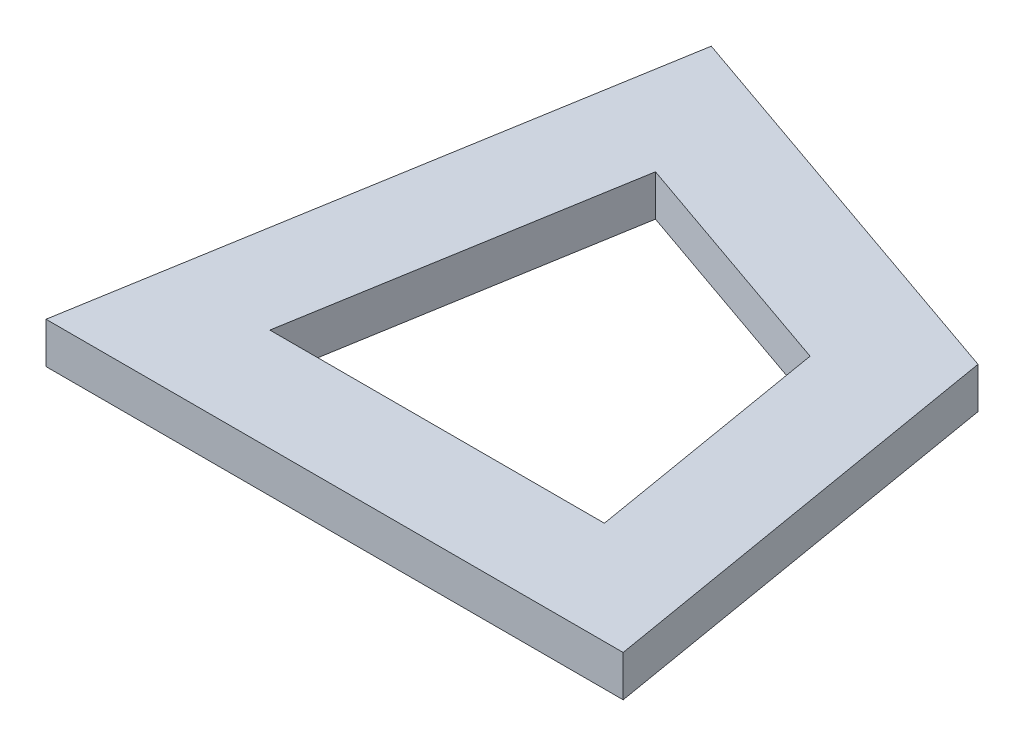
ISO-10303-21;
HEADER;
FILE_DESCRIPTION(('STEP AP214'),'2;1');
FILE_NAME('part.step','',(''),(''),'','','');
FILE_SCHEMA(('AUTOMOTIVE_DESIGN { 1 0 10303 214 1 1 1 1 }'));
ENDSEC;
DATA;
#1=APPLICATION_CONTEXT('core data for automotive mechanical design processes');
#2=APPLICATION_PROTOCOL_DEFINITION('international standard','automotive_design',2000,#1);
#3=PRODUCT_CONTEXT('',#1,'mechanical');
#4=PRODUCT('Part','Part','',(#3));
#5=PRODUCT_RELATED_PRODUCT_CATEGORY('part','',(#4));
#6=PRODUCT_DEFINITION_FORMATION('','',#4);
#7=PRODUCT_DEFINITION_CONTEXT('part definition',#1,'design');
#8=PRODUCT_DEFINITION('design','',#6,#7);
#9=PRODUCT_DEFINITION_SHAPE('','',#8);
#10=(LENGTH_UNIT() NAMED_UNIT(*) SI_UNIT(.MILLI.,.METRE.));
#11=(NAMED_UNIT(*) PLANE_ANGLE_UNIT() SI_UNIT($,.RADIAN.));
#12=(NAMED_UNIT(*) SI_UNIT($,.STERADIAN.) SOLID_ANGLE_UNIT());
#13=UNCERTAINTY_MEASURE_WITH_UNIT(LENGTH_MEASURE(1.E-05),#10,'distance_accuracy_value','');
#14=(GEOMETRIC_REPRESENTATION_CONTEXT(3) GLOBAL_UNCERTAINTY_ASSIGNED_CONTEXT((#13)) GLOBAL_UNIT_ASSIGNED_CONTEXT((#10,
#11,#12)) REPRESENTATION_CONTEXT('',''));
#15=CARTESIAN_POINT('',(0.,0.,0.));
#16=DIRECTION('',(0.,0.,1.));
#17=DIRECTION('',(1.,0.,0.));
#18=AXIS2_PLACEMENT_3D('',#15,#16,#17);
#19=CARTESIAN_POINT('',(0.,2.,0.));
#20=DIRECTION('',(0.,-1.,0.));
#21=DIRECTION('',(0.,0.,-1.));
#22=AXIS2_PLACEMENT_3D('',#19,#20,#21);
#23=PLANE('',#22);
#24=DIRECTION('',(-0.166596655404362,0.,0.986025128689974));
#25=VECTOR('',#24,1.);
#26=CARTESIAN_POINT('',(4.68856094490314,2.,-27.7498902834989));
#27=LINE('',#26,#25);
#28=CARTESIAN_POINT('',(4.68856094490314,2.,-27.7498902834989));
#29=VERTEX_POINT('',#28);
#30=CARTESIAN_POINT('',(0.,2.,0.));
#31=VERTEX_POINT('',#30);
#32=EDGE_CURVE('E140',#29,#31,#27,.T.);
#33=ORIENTED_EDGE('',*,*,#32,.T.);
#34=DIRECTION('',(1.,0.,0.));
#35=VECTOR('',#34,1.);
#36=CARTESIAN_POINT('',(0.,2.,0.));
#37=LINE('',#36,#35);
#38=CARTESIAN_POINT('',(28.14318771,2.,0.));
#39=VERTEX_POINT('',#38);
#40=EDGE_CURVE('E143',#31,#39,#37,.T.);
#41=ORIENTED_EDGE('',*,*,#40,.T.);
#42=DIRECTION('',(-0.166596655404362,0.,-0.986025128689974));
#43=VECTOR('',#42,1.);
#44=CARTESIAN_POINT('',(28.14318771,2.,0.));
#45=LINE('',#44,#43);
#46=CARTESIAN_POINT('',(24.6256301988549,2.,-20.8191460337713));
#47=VERTEX_POINT('',#46);
#48=EDGE_CURVE('E146',#39,#47,#45,.T.);
#49=ORIENTED_EDGE('',*,*,#48,.T.);
#50=DIRECTION('',(-0.944553945341675,0.,-0.328356276534311));
#51=VECTOR('',#50,1.);
#52=CARTESIAN_POINT('',(24.6256301988549,2.,-20.8191460337713));
#53=LINE('',#52,#51);
#54=EDGE_CURVE('E148',#47,#29,#53,.T.);
#55=ORIENTED_EDGE('',*,*,#54,.T.);
#56=EDGE_LOOP('',(#33,#41,#49,#55));
#57=FACE_BOUND('',#56,.T.);
#58=DIRECTION('',(-0.944553945341675,0.,-0.328356276534311));
#59=VECTOR('',#58,1.);
#60=CARTESIAN_POINT('',(20.1885314729947,2.,-17.068115400492));
#61=LINE('',#60,#59);
#62=CARTESIAN_POINT('',(20.1885314729947,2.,-17.068115400492));
#63=VERTEX_POINT('',#62);
#64=CARTESIAN_POINT('',(8.63334965072713,2.,-21.0850553503477));
#65=VERTEX_POINT('',#64);
#66=EDGE_CURVE('E104',#63,#65,#61,.T.);
#67=ORIENTED_EDGE('',*,*,#66,.F.);
#68=DIRECTION('',(-0.166596655404362,0.,-0.986025128689974));
#69=VECTOR('',#68,1.);
#70=CARTESIAN_POINT('',(22.2275339327261,2.,-5.));
#71=LINE('',#70,#69);
#72=CARTESIAN_POINT('',(22.2275339327261,2.,-5.));
#73=VERTEX_POINT('',#72);
#74=EDGE_CURVE('E126',#73,#63,#71,.T.);
#75=ORIENTED_EDGE('',*,*,#74,.F.);
#76=DIRECTION('',(1.,0.,0.));
#77=VECTOR('',#76,1.);
#78=CARTESIAN_POINT('',(5.91565377727388,2.,-5.));
#79=LINE('',#78,#77);
#80=CARTESIAN_POINT('',(5.91565377727388,2.,-5.));
#81=VERTEX_POINT('',#80);
#82=EDGE_CURVE('E124',#81,#73,#79,.T.);
#83=ORIENTED_EDGE('',*,*,#82,.F.);
#84=DIRECTION('',(-0.166596655404362,0.,0.986025128689974));
#85=VECTOR('',#84,1.);
#86=CARTESIAN_POINT('',(8.63334965072713,2.,-21.0850553503477));
#87=LINE('',#86,#85);
#88=EDGE_CURVE('E112',#65,#81,#87,.T.);
#89=ORIENTED_EDGE('',*,*,#88,.F.);
#90=EDGE_LOOP('',(#67,#75,#83,#89));
#91=FACE_BOUND('',#90,.T.);
#92=ADVANCED_FACE('F39',(#57,#91),#23,.F.);
#93=CARTESIAN_POINT('',(0.,0.,0.));
#94=DIRECTION('',(0.,-1.,0.));
#95=DIRECTION('',(0.,0.,-1.));
#96=AXIS2_PLACEMENT_3D('',#93,#94,#95);
#97=PLANE('',#96);
#98=DIRECTION('',(-0.166596655404362,0.,0.986025128689974));
#99=VECTOR('',#98,1.);
#100=CARTESIAN_POINT('',(4.68856094490314,0.,-27.7498902834989));
#101=LINE('',#100,#99);
#102=CARTESIAN_POINT('',(4.68856094490314,0.,-27.7498902834989));
#103=VERTEX_POINT('',#102);
#104=CARTESIAN_POINT('',(0.,0.,0.));
#105=VERTEX_POINT('',#104);
#106=EDGE_CURVE('E120',#103,#105,#101,.T.);
#107=ORIENTED_EDGE('',*,*,#106,.F.);
#108=DIRECTION('',(-0.944553945341675,0.,-0.328356276534311));
#109=VECTOR('',#108,1.);
#110=CARTESIAN_POINT('',(24.6256301988549,0.,-20.8191460337713));
#111=LINE('',#110,#109);
#112=CARTESIAN_POINT('',(24.6256301988549,0.,-20.8191460337713));
#113=VERTEX_POINT('',#112);
#114=EDGE_CURVE('E144',#113,#103,#111,.T.);
#115=ORIENTED_EDGE('',*,*,#114,.F.);
#116=DIRECTION('',(-0.166596655404362,0.,-0.986025128689974));
#117=VECTOR('',#116,1.);
#118=CARTESIAN_POINT('',(28.14318771,0.,0.));
#119=LINE('',#118,#117);
#120=CARTESIAN_POINT('',(28.14318771,0.,0.));
#121=VERTEX_POINT('',#120);
#122=EDGE_CURVE('E155',#121,#113,#119,.T.);
#123=ORIENTED_EDGE('',*,*,#122,.F.);
#124=DIRECTION('',(1.,0.,0.));
#125=VECTOR('',#124,1.);
#126=CARTESIAN_POINT('',(0.,0.,0.));
#127=LINE('',#126,#125);
#128=EDGE_CURVE('E153',#105,#121,#127,.T.);
#129=ORIENTED_EDGE('',*,*,#128,.F.);
#130=EDGE_LOOP('',(#107,#115,#123,#129));
#131=FACE_BOUND('',#130,.T.);
#132=DIRECTION('',(-0.166596655404362,0.,-0.986025128689974));
#133=VECTOR('',#132,1.);
#134=CARTESIAN_POINT('',(22.2275339327261,0.,-5.));
#135=LINE('',#134,#133);
#136=CARTESIAN_POINT('',(22.2275339327261,0.,-5.));
#137=VERTEX_POINT('',#136);
#138=CARTESIAN_POINT('',(20.1885314729947,0.,-17.068115400492));
#139=VERTEX_POINT('',#138);
#140=EDGE_CURVE('E113',#137,#139,#135,.T.);
#141=ORIENTED_EDGE('',*,*,#140,.T.);
#142=DIRECTION('',(-0.944553945341675,0.,-0.328356276534311));
#143=VECTOR('',#142,1.);
#144=CARTESIAN_POINT('',(20.1885314729947,0.,-17.068115400492));
#145=LINE('',#144,#143);
#146=CARTESIAN_POINT('',(8.63334965072713,0.,-21.0850553503477));
#147=VERTEX_POINT('',#146);
#148=EDGE_CURVE('E62',#139,#147,#145,.T.);
#149=ORIENTED_EDGE('',*,*,#148,.T.);
#150=DIRECTION('',(-0.166596655404362,0.,0.986025128689974));
#151=VECTOR('',#150,1.);
#152=CARTESIAN_POINT('',(8.63334965072713,0.,-21.0850553503477));
#153=LINE('',#152,#151);
#154=CARTESIAN_POINT('',(5.91565377727388,0.,-5.));
#155=VERTEX_POINT('',#154);
#156=EDGE_CURVE('E119',#147,#155,#153,.T.);
#157=ORIENTED_EDGE('',*,*,#156,.T.);
#158=DIRECTION('',(1.,0.,0.));
#159=VECTOR('',#158,1.);
#160=CARTESIAN_POINT('',(5.91565377727388,0.,-5.));
#161=LINE('',#160,#159);
#162=EDGE_CURVE('E132',#155,#137,#161,.T.);
#163=ORIENTED_EDGE('',*,*,#162,.T.);
#164=EDGE_LOOP('',(#141,#149,#157,#163));
#165=FACE_BOUND('',#164,.T.);
#166=ADVANCED_FACE('F173',(#131,#165),#97,.T.);
#167=CARTESIAN_POINT('',(4.68856094490314,2.,-27.7498902834989));
#168=DIRECTION('',(0.986025128689974,0.,0.166596655404362));
#169=DIRECTION('',(0.166596655404362,0.,-0.986025128689974));
#170=AXIS2_PLACEMENT_3D('',#167,#168,#169);
#171=PLANE('',#170);
#172=ORIENTED_EDGE('',*,*,#106,.T.);
#173=DIRECTION('',(0.,-1.,0.));
#174=VECTOR('',#173,1.);
#175=CARTESIAN_POINT('',(0.,2.,0.));
#176=LINE('',#175,#174);
#177=EDGE_CURVE('E11',#31,#105,#176,.T.);
#178=ORIENTED_EDGE('',*,*,#177,.F.);
#179=ORIENTED_EDGE('',*,*,#32,.F.);
#180=DIRECTION('',(0.,-1.,0.));
#181=VECTOR('',#180,1.);
#182=CARTESIAN_POINT('',(4.68856094490314,2.,-27.7498902834989));
#183=LINE('',#182,#181);
#184=EDGE_CURVE('E150',#29,#103,#183,.T.);
#185=ORIENTED_EDGE('',*,*,#184,.T.);
#186=EDGE_LOOP('',(#172,#178,#179,#185));
#187=FACE_BOUND('',#186,.T.);
#188=ADVANCED_FACE('F41',(#187),#171,.F.);
#189=CARTESIAN_POINT('',(0.,2.,0.));
#190=DIRECTION('',(0.,0.,-1.));
#191=DIRECTION('',(-1.,0.,0.));
#192=AXIS2_PLACEMENT_3D('',#189,#190,#191);
#193=PLANE('',#192);
#194=ORIENTED_EDGE('',*,*,#128,.T.);
#195=DIRECTION('',(0.,-1.,0.));
#196=VECTOR('',#195,1.);
#197=CARTESIAN_POINT('',(28.14318771,2.,0.));
#198=LINE('',#197,#196);
#199=EDGE_CURVE('E47',#39,#121,#198,.T.);
#200=ORIENTED_EDGE('',*,*,#199,.F.);
#201=ORIENTED_EDGE('',*,*,#40,.F.);
#202=ORIENTED_EDGE('',*,*,#177,.T.);
#203=EDGE_LOOP('',(#194,#200,#201,#202));
#204=FACE_BOUND('',#203,.T.);
#205=ADVANCED_FACE('F183',(#204),#193,.F.);
#206=CARTESIAN_POINT('',(28.14318771,2.,0.));
#207=DIRECTION('',(-0.986025128689974,0.,0.166596655404362));
#208=DIRECTION('',(0.166596655404362,0.,0.986025128689974));
#209=AXIS2_PLACEMENT_3D('',#206,#207,#208);
#210=PLANE('',#209);
#211=ORIENTED_EDGE('',*,*,#122,.T.);
#212=DIRECTION('',(0.,-1.,0.));
#213=VECTOR('',#212,1.);
#214=CARTESIAN_POINT('',(24.6256301988549,2.,-20.8191460337713));
#215=LINE('',#214,#213);
#216=EDGE_CURVE('E160',#47,#113,#215,.T.);
#217=ORIENTED_EDGE('',*,*,#216,.F.);
#218=ORIENTED_EDGE('',*,*,#48,.F.);
#219=ORIENTED_EDGE('',*,*,#199,.T.);
#220=EDGE_LOOP('',(#211,#217,#218,#219));
#221=FACE_BOUND('',#220,.T.);
#222=ADVANCED_FACE('F167',(#221),#210,.F.);
#223=CARTESIAN_POINT('',(24.6256301988549,2.,-20.8191460337713));
#224=DIRECTION('',(-0.328356276534311,0.,0.944553945341675));
#225=DIRECTION('',(0.944553945341675,0.,0.328356276534311));
#226=AXIS2_PLACEMENT_3D('',#223,#224,#225);
#227=PLANE('',#226);
#228=ORIENTED_EDGE('',*,*,#114,.T.);
#229=ORIENTED_EDGE('',*,*,#184,.F.);
#230=ORIENTED_EDGE('',*,*,#54,.F.);
#231=ORIENTED_EDGE('',*,*,#216,.T.);
#232=EDGE_LOOP('',(#228,#229,#230,#231));
#233=FACE_BOUND('',#232,.T.);
#234=ADVANCED_FACE('F177',(#233),#227,.F.);
#235=CARTESIAN_POINT('',(20.1885314729947,2.,-17.068115400492));
#236=DIRECTION('',(-0.328356276534311,0.,0.944553945341675));
#237=DIRECTION('',(0.944553945341675,0.,0.328356276534311));
#238=AXIS2_PLACEMENT_3D('',#235,#236,#237);
#239=PLANE('',#238);
#240=ORIENTED_EDGE('',*,*,#148,.F.);
#241=DIRECTION('',(0.,-1.,0.));
#242=VECTOR('',#241,1.);
#243=CARTESIAN_POINT('',(20.1885314729947,2.,-17.068115400492));
#244=LINE('',#243,#242);
#245=EDGE_CURVE('E108',#63,#139,#244,.T.);
#246=ORIENTED_EDGE('',*,*,#245,.F.);
#247=ORIENTED_EDGE('',*,*,#66,.T.);
#248=DIRECTION('',(0.,-1.,0.));
#249=VECTOR('',#248,1.);
#250=CARTESIAN_POINT('',(8.63334965072713,2.,-21.0850553503477));
#251=LINE('',#250,#249);
#252=EDGE_CURVE('E107',#65,#147,#251,.T.);
#253=ORIENTED_EDGE('',*,*,#252,.T.);
#254=EDGE_LOOP('',(#240,#246,#247,#253));
#255=FACE_BOUND('',#254,.T.);
#256=ADVANCED_FACE('F106',(#255),#239,.T.);
#257=CARTESIAN_POINT('',(8.63334965072713,2.,-21.0850553503477));
#258=DIRECTION('',(0.986025128689974,0.,0.166596655404362));
#259=DIRECTION('',(0.166596655404362,0.,-0.986025128689974));
#260=AXIS2_PLACEMENT_3D('',#257,#258,#259);
#261=PLANE('',#260);
#262=ORIENTED_EDGE('',*,*,#156,.F.);
#263=ORIENTED_EDGE('',*,*,#252,.F.);
#264=ORIENTED_EDGE('',*,*,#88,.T.);
#265=DIRECTION('',(0.,-1.,0.));
#266=VECTOR('',#265,1.);
#267=CARTESIAN_POINT('',(5.91565377727388,2.,-5.));
#268=LINE('',#267,#266);
#269=EDGE_CURVE('E121',#81,#155,#268,.T.);
#270=ORIENTED_EDGE('',*,*,#269,.T.);
#271=EDGE_LOOP('',(#262,#263,#264,#270));
#272=FACE_BOUND('',#271,.T.);
#273=ADVANCED_FACE('F116',(#272),#261,.T.);
#274=CARTESIAN_POINT('',(5.91565377727388,2.,-5.));
#275=DIRECTION('',(0.,0.,-1.));
#276=DIRECTION('',(-1.,0.,0.));
#277=AXIS2_PLACEMENT_3D('',#274,#275,#276);
#278=PLANE('',#277);
#279=ORIENTED_EDGE('',*,*,#162,.F.);
#280=ORIENTED_EDGE('',*,*,#269,.F.);
#281=ORIENTED_EDGE('',*,*,#82,.T.);
#282=DIRECTION('',(0.,-1.,0.));
#283=VECTOR('',#282,1.);
#284=CARTESIAN_POINT('',(22.2275339327261,2.,-5.));
#285=LINE('',#284,#283);
#286=EDGE_CURVE('E54',#73,#137,#285,.T.);
#287=ORIENTED_EDGE('',*,*,#286,.T.);
#288=EDGE_LOOP('',(#279,#280,#281,#287));
#289=FACE_BOUND('',#288,.T.);
#290=ADVANCED_FACE('F206',(#289),#278,.T.);
#291=CARTESIAN_POINT('',(22.2275339327261,2.,-5.));
#292=DIRECTION('',(-0.986025128689974,0.,0.166596655404362));
#293=DIRECTION('',(0.166596655404362,0.,0.986025128689974));
#294=AXIS2_PLACEMENT_3D('',#291,#292,#293);
#295=PLANE('',#294);
#296=ORIENTED_EDGE('',*,*,#140,.F.);
#297=ORIENTED_EDGE('',*,*,#286,.F.);
#298=ORIENTED_EDGE('',*,*,#74,.T.);
#299=ORIENTED_EDGE('',*,*,#245,.T.);
#300=EDGE_LOOP('',(#296,#297,#298,#299));
#301=FACE_BOUND('',#300,.T.);
#302=ADVANCED_FACE('F210',(#301),#295,.T.);
#303=CLOSED_SHELL('',(#92,#166,#188,#205,#222,#234,#256,#273,#290,#302));
#304=MANIFOLD_SOLID_BREP('B2',#303);
#305=ADVANCED_BREP_SHAPE_REPRESENTATION('',(#18,#304),#14);
#306=SHAPE_DEFINITION_REPRESENTATION(#9,#305);
ENDSEC;
END-ISO-10303-21;
